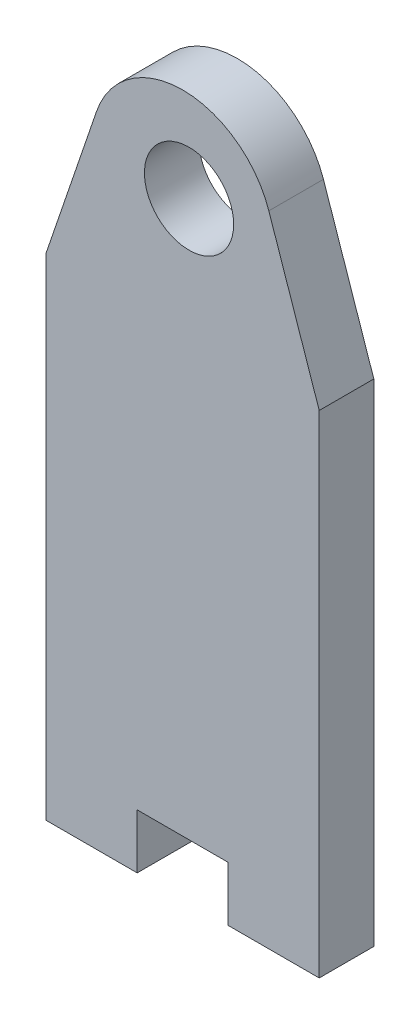
ISO-10303-21;
HEADER;
FILE_DESCRIPTION(('STEP AP214'),'2;1');
FILE_NAME('part.step','',(''),(''),'','','');
FILE_SCHEMA(('AUTOMOTIVE_DESIGN { 1 0 10303 214 1 1 1 1 }'));
ENDSEC;
DATA;
#1=APPLICATION_CONTEXT('core data for automotive mechanical design processes');
#2=APPLICATION_PROTOCOL_DEFINITION('international standard','automotive_design',2000,#1);
#3=PRODUCT_CONTEXT('',#1,'mechanical');
#4=PRODUCT('Part','Part','',(#3));
#5=PRODUCT_RELATED_PRODUCT_CATEGORY('part','',(#4));
#6=PRODUCT_DEFINITION_FORMATION('','',#4);
#7=PRODUCT_DEFINITION_CONTEXT('part definition',#1,'design');
#8=PRODUCT_DEFINITION('design','',#6,#7);
#9=PRODUCT_DEFINITION_SHAPE('','',#8);
#10=(LENGTH_UNIT() NAMED_UNIT(*) SI_UNIT(.MILLI.,.METRE.));
#11=(NAMED_UNIT(*) PLANE_ANGLE_UNIT() SI_UNIT($,.RADIAN.));
#12=(NAMED_UNIT(*) SI_UNIT($,.STERADIAN.) SOLID_ANGLE_UNIT());
#13=UNCERTAINTY_MEASURE_WITH_UNIT(LENGTH_MEASURE(1.E-05),#10,'distance_accuracy_value','');
#14=(GEOMETRIC_REPRESENTATION_CONTEXT(3) GLOBAL_UNCERTAINTY_ASSIGNED_CONTEXT((#13)) GLOBAL_UNIT_ASSIGNED_CONTEXT((#10,
#11,#12)) REPRESENTATION_CONTEXT('',''));
#15=CARTESIAN_POINT('',(0.,0.,0.));
#16=DIRECTION('',(0.,0.,1.));
#17=DIRECTION('',(1.,0.,0.));
#18=AXIS2_PLACEMENT_3D('',#15,#16,#17);
#19=CARTESIAN_POINT('',(43.0000000000136,48.2499999999982,3.));
#20=DIRECTION('',(0.,0.,1.));
#21=DIRECTION('',(1.,0.,0.));
#22=AXIS2_PLACEMENT_3D('',#19,#20,#21);
#23=PLANE('',#22);
#24=CARTESIAN_POINT('',(43.0000000000136,48.2499999999982,3.));
#25=DIRECTION('',(0.,0.,1.));
#26=DIRECTION('',(1.,0.,0.));
#27=AXIS2_PLACEMENT_3D('',#24,#25,#26);
#28=CIRCLE('',#27,5.00000000001396);
#29=CARTESIAN_POINT('',(47.732278763896,49.8641678044865,3.));
#30=VERTEX_POINT('',#29);
#31=CARTESIAN_POINT('',(38.2677212361221,49.8641678044602,3.));
#32=VERTEX_POINT('',#31);
#33=EDGE_CURVE('E162',#30,#32,#28,.T.);
#34=ORIENTED_EDGE('',*,*,#33,.T.);
#35=DIRECTION('',(-0.322833560893455,-0.946455752774979,0.));
#36=VECTOR('',#35,1.);
#37=CARTESIAN_POINT('',(35.5000000000005,41.7499999999879,3.));
#38=LINE('',#37,#36);
#39=CARTESIAN_POINT('',(35.5000000000005,41.7499999999879,3.));
#40=VERTEX_POINT('',#39);
#41=EDGE_CURVE('E98',#32,#40,#38,.T.);
#42=ORIENTED_EDGE('',*,*,#41,.T.);
#43=DIRECTION('',(0.,-1.,0.));
#44=VECTOR('',#43,1.);
#45=CARTESIAN_POINT('',(35.5000000000005,27.7499999999879,3.));
#46=LINE('',#45,#44);
#47=CARTESIAN_POINT('',(35.5000000000005,14.7499999999879,3.));
#48=VERTEX_POINT('',#47);
#49=EDGE_CURVE('E182',#40,#48,#46,.T.);
#50=ORIENTED_EDGE('',*,*,#49,.T.);
#51=DIRECTION('',(1.,2.15799600411554E-13,0.));
#52=VECTOR('',#51,1.);
#53=CARTESIAN_POINT('',(40.4999999999995,14.749999999989,3.));
#54=LINE('',#53,#52);
#55=CARTESIAN_POINT('',(40.4999999999995,14.749999999989,3.));
#56=VERTEX_POINT('',#55);
#57=EDGE_CURVE('E203',#48,#56,#54,.T.);
#58=ORIENTED_EDGE('',*,*,#57,.T.);
#59=DIRECTION('',(0.,1.,0.));
#60=VECTOR('',#59,1.);
#61=CARTESIAN_POINT('',(40.4999999999995,17.749999999989,3.));
#62=LINE('',#61,#60);
#63=CARTESIAN_POINT('',(40.4999999999995,17.749999999989,3.));
#64=VERTEX_POINT('',#63);
#65=EDGE_CURVE('E200',#56,#64,#62,.T.);
#66=ORIENTED_EDGE('',*,*,#65,.T.);
#67=DIRECTION('',(1.,0.,0.));
#68=VECTOR('',#67,1.);
#69=CARTESIAN_POINT('',(45.4999999999995,17.749999999989,3.));
#70=LINE('',#69,#68);
#71=CARTESIAN_POINT('',(45.4999999999995,17.749999999989,3.));
#72=VERTEX_POINT('',#71);
#73=EDGE_CURVE('E202',#64,#72,#70,.T.);
#74=ORIENTED_EDGE('',*,*,#73,.T.);
#75=DIRECTION('',(0.,-1.,0.));
#76=VECTOR('',#75,1.);
#77=CARTESIAN_POINT('',(45.4999999999995,14.749999999989,3.));
#78=LINE('',#77,#76);
#79=CARTESIAN_POINT('',(45.4999999999995,14.749999999989,3.));
#80=VERTEX_POINT('',#79);
#81=EDGE_CURVE('E123',#72,#80,#78,.T.);
#82=ORIENTED_EDGE('',*,*,#81,.T.);
#83=DIRECTION('',(1.,0.,0.));
#84=VECTOR('',#83,1.);
#85=CARTESIAN_POINT('',(50.4999999999995,14.749999999989,3.));
#86=LINE('',#85,#84);
#87=CARTESIAN_POINT('',(50.4999999999995,14.749999999989,3.));
#88=VERTEX_POINT('',#87);
#89=EDGE_CURVE('E117',#80,#88,#86,.T.);
#90=ORIENTED_EDGE('',*,*,#89,.T.);
#91=DIRECTION('',(0.,1.,0.));
#92=VECTOR('',#91,1.);
#93=CARTESIAN_POINT('',(50.4999999999995,27.7499999999885,3.));
#94=LINE('',#93,#92);
#95=CARTESIAN_POINT('',(50.4999999999995,41.7499999999879,3.));
#96=VERTEX_POINT('',#95);
#97=EDGE_CURVE('E121',#88,#96,#94,.T.);
#98=ORIENTED_EDGE('',*,*,#97,.T.);
#99=DIRECTION('',(-0.322833560890624,0.946455752775945,0.));
#100=VECTOR('',#99,1.);
#101=CARTESIAN_POINT('',(47.732278763896,49.8641678044865,3.));
#102=LINE('',#101,#100);
#103=EDGE_CURVE('E50',#96,#30,#102,.T.);
#104=ORIENTED_EDGE('',*,*,#103,.T.);
#105=EDGE_LOOP('',(#34,#42,#50,#58,#66,#74,#82,#90,#98,#104));
#106=FACE_BOUND('',#105,.T.);
#107=CARTESIAN_POINT('',(43.3485823774418,48.2499999999877,3.));
#108=DIRECTION('',(0.,0.,1.));
#109=DIRECTION('',(1.,0.,0.));
#110=AXIS2_PLACEMENT_3D('',#107,#108,#109);
#111=CIRCLE('',#110,2.45);
#112=CARTESIAN_POINT('',(45.7985823774417,48.2499999999877,3.));
#113=VERTEX_POINT('',#112);
#114=EDGE_CURVE('E146',#113,#113,#111,.T.);
#115=ORIENTED_EDGE('',*,*,#114,.F.);
#116=EDGE_LOOP('',(#115));
#117=FACE_BOUND('',#116,.T.);
#118=ADVANCED_FACE('F33',(#106,#117),#23,.T.);
#119=CARTESIAN_POINT('',(43.0000000000136,48.2499999999982,0.));
#120=DIRECTION('',(0.,0.,1.));
#121=DIRECTION('',(1.,0.,0.));
#122=AXIS2_PLACEMENT_3D('',#119,#120,#121);
#123=PLANE('',#122);
#124=CARTESIAN_POINT('',(43.0000000000136,48.2499999999982,0.));
#125=DIRECTION('',(0.,0.,1.));
#126=DIRECTION('',(1.,0.,0.));
#127=AXIS2_PLACEMENT_3D('',#124,#125,#126);
#128=CIRCLE('',#127,5.00000000001396);
#129=CARTESIAN_POINT('',(47.732278763896,49.8641678044865,0.));
#130=VERTEX_POINT('',#129);
#131=CARTESIAN_POINT('',(38.2677212361221,49.8641678044602,0.));
#132=VERTEX_POINT('',#131);
#133=EDGE_CURVE('E142',#130,#132,#128,.T.);
#134=ORIENTED_EDGE('',*,*,#133,.F.);
#135=DIRECTION('',(-0.322833560890624,0.946455752775945,0.));
#136=VECTOR('',#135,1.);
#137=CARTESIAN_POINT('',(47.732278763896,49.8641678044865,0.));
#138=LINE('',#137,#136);
#139=CARTESIAN_POINT('',(50.4999999999995,41.7499999999879,0.));
#140=VERTEX_POINT('',#139);
#141=EDGE_CURVE('E90',#140,#130,#138,.T.);
#142=ORIENTED_EDGE('',*,*,#141,.F.);
#143=DIRECTION('',(0.,1.,0.));
#144=VECTOR('',#143,1.);
#145=CARTESIAN_POINT('',(50.4999999999995,41.7499999999879,0.));
#146=LINE('',#145,#144);
#147=CARTESIAN_POINT('',(50.4999999999995,14.749999999989,0.));
#148=VERTEX_POINT('',#147);
#149=EDGE_CURVE('E84',#148,#140,#146,.T.);
#150=ORIENTED_EDGE('',*,*,#149,.F.);
#151=DIRECTION('',(1.,0.,0.));
#152=VECTOR('',#151,1.);
#153=CARTESIAN_POINT('',(50.4999999999995,14.749999999989,0.));
#154=LINE('',#153,#152);
#155=CARTESIAN_POINT('',(45.4999999999995,14.749999999989,0.));
#156=VERTEX_POINT('',#155);
#157=EDGE_CURVE('E132',#156,#148,#154,.T.);
#158=ORIENTED_EDGE('',*,*,#157,.F.);
#159=DIRECTION('',(0.,-1.,0.));
#160=VECTOR('',#159,1.);
#161=CARTESIAN_POINT('',(45.4999999999995,14.749999999989,0.));
#162=LINE('',#161,#160);
#163=CARTESIAN_POINT('',(45.4999999999995,17.749999999989,0.));
#164=VERTEX_POINT('',#163);
#165=EDGE_CURVE('E157',#164,#156,#162,.T.);
#166=ORIENTED_EDGE('',*,*,#165,.F.);
#167=DIRECTION('',(1.,0.,0.));
#168=VECTOR('',#167,1.);
#169=CARTESIAN_POINT('',(45.4999999999995,17.749999999989,0.));
#170=LINE('',#169,#168);
#171=CARTESIAN_POINT('',(40.4999999999995,17.749999999989,0.));
#172=VERTEX_POINT('',#171);
#173=EDGE_CURVE('E155',#172,#164,#170,.T.);
#174=ORIENTED_EDGE('',*,*,#173,.F.);
#175=DIRECTION('',(0.,1.,0.));
#176=VECTOR('',#175,1.);
#177=CARTESIAN_POINT('',(40.4999999999995,17.749999999989,0.));
#178=LINE('',#177,#176);
#179=CARTESIAN_POINT('',(40.4999999999995,14.749999999989,0.));
#180=VERTEX_POINT('',#179);
#181=EDGE_CURVE('E153',#180,#172,#178,.T.);
#182=ORIENTED_EDGE('',*,*,#181,.F.);
#183=DIRECTION('',(1.,2.15799600411554E-13,0.));
#184=VECTOR('',#183,1.);
#185=CARTESIAN_POINT('',(40.4999999999995,14.749999999989,0.));
#186=LINE('',#185,#184);
#187=CARTESIAN_POINT('',(35.5000000000005,14.7499999999879,0.));
#188=VERTEX_POINT('',#187);
#189=EDGE_CURVE('E151',#188,#180,#186,.T.);
#190=ORIENTED_EDGE('',*,*,#189,.F.);
#191=DIRECTION('',(0.,-1.,0.));
#192=VECTOR('',#191,1.);
#193=CARTESIAN_POINT('',(35.5000000000005,14.7499999999879,0.));
#194=LINE('',#193,#192);
#195=CARTESIAN_POINT('',(35.5000000000005,41.7499999999879,0.));
#196=VERTEX_POINT('',#195);
#197=EDGE_CURVE('E149',#196,#188,#194,.T.);
#198=ORIENTED_EDGE('',*,*,#197,.F.);
#199=DIRECTION('',(-0.322833560893455,-0.946455752774979,0.));
#200=VECTOR('',#199,1.);
#201=CARTESIAN_POINT('',(35.5000000000005,41.7499999999879,0.));
#202=LINE('',#201,#200);
#203=EDGE_CURVE('E145',#132,#196,#202,.T.);
#204=ORIENTED_EDGE('',*,*,#203,.F.);
#205=EDGE_LOOP('',(#134,#142,#150,#158,#166,#174,#182,#190,#198,#204));
#206=FACE_BOUND('',#205,.T.);
#207=CARTESIAN_POINT('',(43.3485823774418,48.2499999999877,0.));
#208=DIRECTION('',(0.,0.,1.));
#209=DIRECTION('',(1.,0.,0.));
#210=AXIS2_PLACEMENT_3D('',#207,#208,#209);
#211=CIRCLE('',#210,2.45);
#212=CARTESIAN_POINT('',(45.7985823774417,48.2499999999877,0.));
#213=VERTEX_POINT('',#212);
#214=EDGE_CURVE('E211',#213,#213,#211,.T.);
#215=ORIENTED_EDGE('',*,*,#214,.T.);
#216=EDGE_LOOP('',(#215));
#217=FACE_BOUND('',#216,.T.);
#218=ADVANCED_FACE('F187',(#206,#217),#123,.F.);
#219=CARTESIAN_POINT('',(43.0000000000136,48.2499999999982,3.));
#220=DIRECTION('',(0.,0.,-1.));
#221=DIRECTION('',(-1.,0.,0.));
#222=AXIS2_PLACEMENT_3D('',#219,#220,#221);
#223=CYLINDRICAL_SURFACE('',#222,5.00000000001396);
#224=ORIENTED_EDGE('',*,*,#133,.T.);
#225=DIRECTION('',(0.,0.,-1.));
#226=VECTOR('',#225,1.);
#227=CARTESIAN_POINT('',(38.2677212361221,49.8641678044602,3.));
#228=LINE('',#227,#226);
#229=EDGE_CURVE('E11',#32,#132,#228,.T.);
#230=ORIENTED_EDGE('',*,*,#229,.F.);
#231=ORIENTED_EDGE('',*,*,#33,.F.);
#232=DIRECTION('',(0.,0.,-1.));
#233=VECTOR('',#232,1.);
#234=CARTESIAN_POINT('',(47.732278763896,49.8641678044865,3.));
#235=LINE('',#234,#233);
#236=EDGE_CURVE('E138',#30,#130,#235,.T.);
#237=ORIENTED_EDGE('',*,*,#236,.T.);
#238=EDGE_LOOP('',(#224,#230,#231,#237));
#239=FACE_BOUND('',#238,.T.);
#240=ADVANCED_FACE('F35',(#239),#223,.T.);
#241=CARTESIAN_POINT('',(35.5000000000005,41.7499999999879,3.));
#242=DIRECTION('',(0.946455752774979,-0.322833560893455,0.));
#243=DIRECTION('',(0.322833560893455,0.946455752774979,0.));
#244=AXIS2_PLACEMENT_3D('',#241,#242,#243);
#245=PLANE('',#244);
#246=ORIENTED_EDGE('',*,*,#203,.T.);
#247=DIRECTION('',(0.,0.,-1.));
#248=VECTOR('',#247,1.);
#249=CARTESIAN_POINT('',(35.5000000000005,41.7499999999879,3.));
#250=LINE('',#249,#248);
#251=EDGE_CURVE('E42',#40,#196,#250,.T.);
#252=ORIENTED_EDGE('',*,*,#251,.F.);
#253=ORIENTED_EDGE('',*,*,#41,.F.);
#254=ORIENTED_EDGE('',*,*,#229,.T.);
#255=EDGE_LOOP('',(#246,#252,#253,#254));
#256=FACE_BOUND('',#255,.T.);
#257=ADVANCED_FACE('F183',(#256),#245,.F.);
#258=CARTESIAN_POINT('',(35.5000000000005,14.7499999999879,3.));
#259=DIRECTION('',(1.,0.,0.));
#260=DIRECTION('',(0.,0.,-1.));
#261=AXIS2_PLACEMENT_3D('',#258,#259,#260);
#262=PLANE('',#261);
#263=ORIENTED_EDGE('',*,*,#197,.T.);
#264=DIRECTION('',(0.,0.,-1.));
#265=VECTOR('',#264,1.);
#266=CARTESIAN_POINT('',(35.5000000000005,14.7499999999879,3.));
#267=LINE('',#266,#265);
#268=EDGE_CURVE('E175',#48,#188,#267,.T.);
#269=ORIENTED_EDGE('',*,*,#268,.F.);
#270=ORIENTED_EDGE('',*,*,#49,.F.);
#271=ORIENTED_EDGE('',*,*,#251,.T.);
#272=EDGE_LOOP('',(#263,#269,#270,#271));
#273=FACE_BOUND('',#272,.T.);
#274=ADVANCED_FACE('F180',(#273),#262,.F.);
#275=CARTESIAN_POINT('',(40.4999999999995,14.749999999989,3.));
#276=DIRECTION('',(-2.15799600411554E-13,1.,0.));
#277=DIRECTION('',(-1.,-2.15799600411554E-13,0.));
#278=AXIS2_PLACEMENT_3D('',#275,#276,#277);
#279=PLANE('',#278);
#280=ORIENTED_EDGE('',*,*,#189,.T.);
#281=DIRECTION('',(0.,0.,-1.));
#282=VECTOR('',#281,1.);
#283=CARTESIAN_POINT('',(40.4999999999995,14.749999999989,3.));
#284=LINE('',#283,#282);
#285=EDGE_CURVE('E172',#56,#180,#284,.T.);
#286=ORIENTED_EDGE('',*,*,#285,.F.);
#287=ORIENTED_EDGE('',*,*,#57,.F.);
#288=ORIENTED_EDGE('',*,*,#268,.T.);
#289=EDGE_LOOP('',(#280,#286,#287,#288));
#290=FACE_BOUND('',#289,.T.);
#291=ADVANCED_FACE('F194',(#290),#279,.F.);
#292=CARTESIAN_POINT('',(40.4999999999995,17.749999999989,3.));
#293=DIRECTION('',(-1.,0.,0.));
#294=DIRECTION('',(0.,0.,1.));
#295=AXIS2_PLACEMENT_3D('',#292,#293,#294);
#296=PLANE('',#295);
#297=ORIENTED_EDGE('',*,*,#181,.T.);
#298=DIRECTION('',(0.,0.,-1.));
#299=VECTOR('',#298,1.);
#300=CARTESIAN_POINT('',(40.4999999999995,17.749999999989,3.));
#301=LINE('',#300,#299);
#302=EDGE_CURVE('E169',#64,#172,#301,.T.);
#303=ORIENTED_EDGE('',*,*,#302,.F.);
#304=ORIENTED_EDGE('',*,*,#65,.F.);
#305=ORIENTED_EDGE('',*,*,#285,.T.);
#306=EDGE_LOOP('',(#297,#303,#304,#305));
#307=FACE_BOUND('',#306,.T.);
#308=ADVANCED_FACE('F198',(#307),#296,.F.);
#309=CARTESIAN_POINT('',(45.4999999999995,17.749999999989,3.));
#310=DIRECTION('',(0.,1.,0.));
#311=DIRECTION('',(0.,0.,1.));
#312=AXIS2_PLACEMENT_3D('',#309,#310,#311);
#313=PLANE('',#312);
#314=ORIENTED_EDGE('',*,*,#173,.T.);
#315=DIRECTION('',(0.,0.,-1.));
#316=VECTOR('',#315,1.);
#317=CARTESIAN_POINT('',(45.4999999999995,17.749999999989,3.));
#318=LINE('',#317,#316);
#319=EDGE_CURVE('E166',#72,#164,#318,.T.);
#320=ORIENTED_EDGE('',*,*,#319,.F.);
#321=ORIENTED_EDGE('',*,*,#73,.F.);
#322=ORIENTED_EDGE('',*,*,#302,.T.);
#323=EDGE_LOOP('',(#314,#320,#321,#322));
#324=FACE_BOUND('',#323,.T.);
#325=ADVANCED_FACE('F237',(#324),#313,.F.);
#326=CARTESIAN_POINT('',(45.4999999999995,14.749999999989,3.));
#327=DIRECTION('',(1.,0.,0.));
#328=DIRECTION('',(0.,0.,-1.));
#329=AXIS2_PLACEMENT_3D('',#326,#327,#328);
#330=PLANE('',#329);
#331=ORIENTED_EDGE('',*,*,#165,.T.);
#332=DIRECTION('',(0.,0.,-1.));
#333=VECTOR('',#332,1.);
#334=CARTESIAN_POINT('',(45.4999999999995,14.749999999989,3.));
#335=LINE('',#334,#333);
#336=EDGE_CURVE('E133',#80,#156,#335,.T.);
#337=ORIENTED_EDGE('',*,*,#336,.F.);
#338=ORIENTED_EDGE('',*,*,#81,.F.);
#339=ORIENTED_EDGE('',*,*,#319,.T.);
#340=EDGE_LOOP('',(#331,#337,#338,#339));
#341=FACE_BOUND('',#340,.T.);
#342=ADVANCED_FACE('F234',(#341),#330,.F.);
#343=CARTESIAN_POINT('',(50.4999999999995,14.749999999989,3.));
#344=DIRECTION('',(0.,1.,0.));
#345=DIRECTION('',(0.,0.,1.));
#346=AXIS2_PLACEMENT_3D('',#343,#344,#345);
#347=PLANE('',#346);
#348=ORIENTED_EDGE('',*,*,#157,.T.);
#349=DIRECTION('',(0.,0.,-1.));
#350=VECTOR('',#349,1.);
#351=CARTESIAN_POINT('',(50.4999999999995,14.749999999989,3.));
#352=LINE('',#351,#350);
#353=EDGE_CURVE('E129',#88,#148,#352,.T.);
#354=ORIENTED_EDGE('',*,*,#353,.F.);
#355=ORIENTED_EDGE('',*,*,#89,.F.);
#356=ORIENTED_EDGE('',*,*,#336,.T.);
#357=EDGE_LOOP('',(#348,#354,#355,#356));
#358=FACE_BOUND('',#357,.T.);
#359=ADVANCED_FACE('F130',(#358),#347,.F.);
#360=CARTESIAN_POINT('',(50.4999999999995,41.7499999999879,3.));
#361=DIRECTION('',(-1.,0.,0.));
#362=DIRECTION('',(0.,0.,1.));
#363=AXIS2_PLACEMENT_3D('',#360,#361,#362);
#364=PLANE('',#363);
#365=ORIENTED_EDGE('',*,*,#149,.T.);
#366=DIRECTION('',(0.,0.,-1.));
#367=VECTOR('',#366,1.);
#368=CARTESIAN_POINT('',(50.4999999999995,41.7499999999879,3.));
#369=LINE('',#368,#367);
#370=EDGE_CURVE('E134',#96,#140,#369,.T.);
#371=ORIENTED_EDGE('',*,*,#370,.F.);
#372=ORIENTED_EDGE('',*,*,#97,.F.);
#373=ORIENTED_EDGE('',*,*,#353,.T.);
#374=EDGE_LOOP('',(#365,#371,#372,#373));
#375=FACE_BOUND('',#374,.T.);
#376=ADVANCED_FACE('F136',(#375),#364,.F.);
#377=CARTESIAN_POINT('',(47.732278763896,49.8641678044865,3.));
#378=DIRECTION('',(-0.946455752775945,-0.322833560890624,0.));
#379=DIRECTION('',(0.322833560890624,-0.946455752775945,0.));
#380=AXIS2_PLACEMENT_3D('',#377,#378,#379);
#381=PLANE('',#380);
#382=ORIENTED_EDGE('',*,*,#141,.T.);
#383=ORIENTED_EDGE('',*,*,#236,.F.);
#384=ORIENTED_EDGE('',*,*,#103,.F.);
#385=ORIENTED_EDGE('',*,*,#370,.T.);
#386=EDGE_LOOP('',(#382,#383,#384,#385));
#387=FACE_BOUND('',#386,.T.);
#388=ADVANCED_FACE('F227',(#387),#381,.F.);
#389=CARTESIAN_POINT('',(43.3485823774418,48.2499999999877,3.));
#390=DIRECTION('',(0.,0.,-1.));
#391=DIRECTION('',(-1.,0.,0.));
#392=AXIS2_PLACEMENT_3D('',#389,#390,#391);
#393=CYLINDRICAL_SURFACE('',#392,2.45);
#394=ORIENTED_EDGE('',*,*,#114,.T.);
#395=EDGE_LOOP('',(#394));
#396=FACE_BOUND('',#395,.T.);
#397=ORIENTED_EDGE('',*,*,#214,.F.);
#398=EDGE_LOOP('',(#397));
#399=FACE_BOUND('',#398,.T.);
#400=ADVANCED_FACE('F217',(#396,#399),#393,.F.);
#401=CLOSED_SHELL('',(#118,#218,#240,#257,#274,#291,#308,#325,#342,#359,#376,#388,#400));
#402=MANIFOLD_SOLID_BREP('B2',#401);
#403=ADVANCED_BREP_SHAPE_REPRESENTATION('',(#18,#402),#14);
#404=SHAPE_DEFINITION_REPRESENTATION(#9,#403);
ENDSEC;
END-ISO-10303-21;
